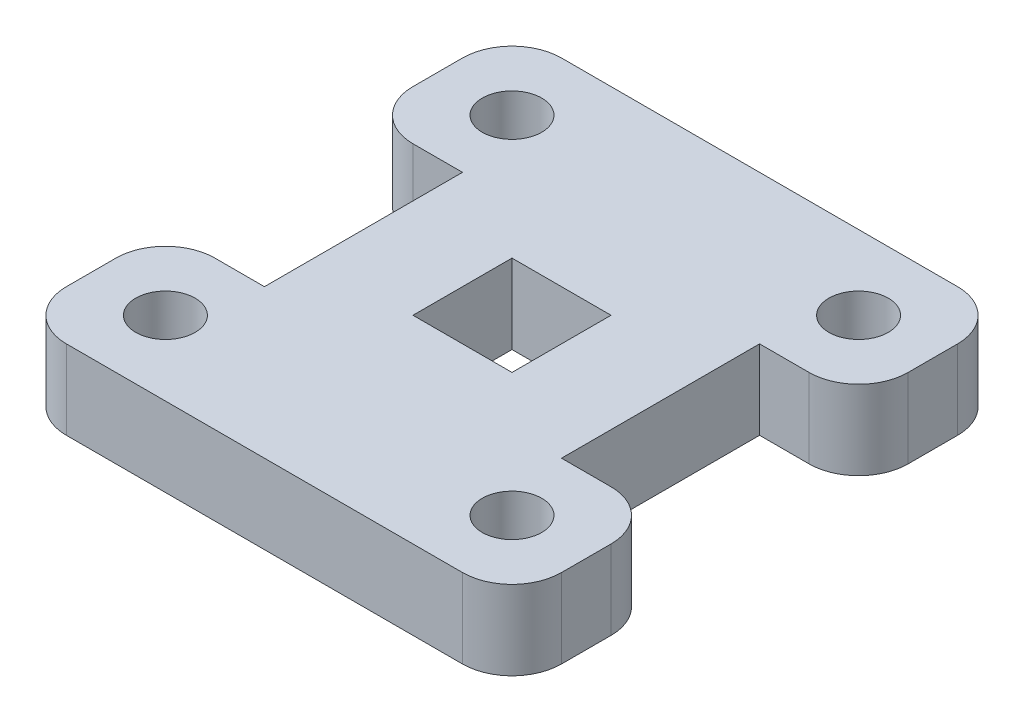
ISO-10303-21;
HEADER;
FILE_DESCRIPTION(('STEP AP214'),'2;1');
FILE_NAME('part.step','',(''),(''),'','','');
FILE_SCHEMA(('AUTOMOTIVE_DESIGN { 1 0 10303 214 1 1 1 1 }'));
ENDSEC;
DATA;
#1=APPLICATION_CONTEXT('core data for automotive mechanical design processes');
#2=APPLICATION_PROTOCOL_DEFINITION('international standard','automotive_design',2000,#1);
#3=PRODUCT_CONTEXT('',#1,'mechanical');
#4=PRODUCT('Part','Part','',(#3));
#5=PRODUCT_RELATED_PRODUCT_CATEGORY('part','',(#4));
#6=PRODUCT_DEFINITION_FORMATION('','',#4);
#7=PRODUCT_DEFINITION_CONTEXT('part definition',#1,'design');
#8=PRODUCT_DEFINITION('design','',#6,#7);
#9=PRODUCT_DEFINITION_SHAPE('','',#8);
#10=(LENGTH_UNIT() NAMED_UNIT(*) SI_UNIT(.MILLI.,.METRE.));
#11=(NAMED_UNIT(*) PLANE_ANGLE_UNIT() SI_UNIT($,.RADIAN.));
#12=(NAMED_UNIT(*) SI_UNIT($,.STERADIAN.) SOLID_ANGLE_UNIT());
#13=UNCERTAINTY_MEASURE_WITH_UNIT(LENGTH_MEASURE(1.E-05),#10,'distance_accuracy_value','');
#14=(GEOMETRIC_REPRESENTATION_CONTEXT(3) GLOBAL_UNCERTAINTY_ASSIGNED_CONTEXT((#13)) GLOBAL_UNIT_ASSIGNED_CONTEXT((#10,
#11,#12)) REPRESENTATION_CONTEXT('',''));
#15=CARTESIAN_POINT('',(0.,0.,0.));
#16=DIRECTION('',(0.,0.,1.));
#17=DIRECTION('',(1.,0.,0.));
#18=AXIS2_PLACEMENT_3D('',#15,#16,#17);
#19=CARTESIAN_POINT('',(-40.,16.,30.));
#20=DIRECTION('',(0.,1.,0.));
#21=DIRECTION('',(0.,0.,1.));
#22=AXIS2_PLACEMENT_3D('',#19,#20,#21);
#23=PLANE('',#22);
#24=CARTESIAN_POINT('',(35.,16.,35.));
#25=DIRECTION('',(0.,1.,0.));
#26=DIRECTION('',(0.,0.,1.));
#27=AXIS2_PLACEMENT_3D('',#24,#25,#26);
#28=CIRCLE('',#27,5.99999999999999);
#29=CARTESIAN_POINT('',(35.,16.,41.));
#30=VERTEX_POINT('',#29);
#31=EDGE_CURVE('E877',#30,#30,#28,.T.);
#32=ORIENTED_EDGE('',*,*,#31,.F.);
#33=EDGE_LOOP('',(#32));
#34=FACE_BOUND('',#33,.T.);
#35=CARTESIAN_POINT('',(-35.,16.,-35.));
#36=DIRECTION('',(0.,1.,0.));
#37=DIRECTION('',(0.,0.,1.));
#38=AXIS2_PLACEMENT_3D('',#35,#36,#37);
#39=CIRCLE('',#38,5.99999999999999);
#40=CARTESIAN_POINT('',(-35.,16.,-29.));
#41=VERTEX_POINT('',#40);
#42=EDGE_CURVE('E240',#41,#41,#39,.T.);
#43=ORIENTED_EDGE('',*,*,#42,.F.);
#44=EDGE_LOOP('',(#43));
#45=FACE_BOUND('',#44,.T.);
#46=DIRECTION('',(1.,0.,0.));
#47=VECTOR('',#46,1.);
#48=CARTESIAN_POINT('',(-39.9999999999999,16.,-20.));
#49=LINE('',#48,#47);
#50=CARTESIAN_POINT('',(-39.9999999999999,16.,-20.));
#51=VERTEX_POINT('',#50);
#52=CARTESIAN_POINT('',(-30.,16.,-20.));
#53=VERTEX_POINT('',#52);
#54=EDGE_CURVE('E256',#51,#53,#49,.T.);
#55=ORIENTED_EDGE('',*,*,#54,.T.);
#56=DIRECTION('',(0.,0.,1.));
#57=VECTOR('',#56,1.);
#58=CARTESIAN_POINT('',(-30.,16.,-20.));
#59=LINE('',#58,#57);
#60=CARTESIAN_POINT('',(-30.,16.,20.));
#61=VERTEX_POINT('',#60);
#62=EDGE_CURVE('E260',#53,#61,#59,.T.);
#63=ORIENTED_EDGE('',*,*,#62,.T.);
#64=DIRECTION('',(-1.,0.,0.));
#65=VECTOR('',#64,1.);
#66=CARTESIAN_POINT('',(-39.9999999999999,16.,20.));
#67=LINE('',#66,#65);
#68=CARTESIAN_POINT('',(-39.9999999999999,16.,20.));
#69=VERTEX_POINT('',#68);
#70=EDGE_CURVE('E264',#61,#69,#67,.T.);
#71=ORIENTED_EDGE('',*,*,#70,.T.);
#72=CARTESIAN_POINT('',(-40.,16.,30.));
#73=DIRECTION('',(0.,1.,0.));
#74=DIRECTION('',(0.,0.,1.));
#75=AXIS2_PLACEMENT_3D('',#72,#73,#74);
#76=CIRCLE('',#75,10.);
#77=CARTESIAN_POINT('',(-50.,16.,30.0000000000001));
#78=VERTEX_POINT('',#77);
#79=EDGE_CURVE('E267',#69,#78,#76,.T.);
#80=ORIENTED_EDGE('',*,*,#79,.T.);
#81=DIRECTION('',(0.,0.,1.));
#82=VECTOR('',#81,1.);
#83=CARTESIAN_POINT('',(-50.,16.,39.9999999999999));
#84=LINE('',#83,#82);
#85=CARTESIAN_POINT('',(-50.,16.,39.9999999999999));
#86=VERTEX_POINT('',#85);
#87=EDGE_CURVE('E270',#78,#86,#84,.T.);
#88=ORIENTED_EDGE('',*,*,#87,.T.);
#89=CARTESIAN_POINT('',(-40.,16.,40.));
#90=DIRECTION('',(0.,1.,0.));
#91=DIRECTION('',(0.,0.,-1.));
#92=AXIS2_PLACEMENT_3D('',#89,#90,#91);
#93=CIRCLE('',#92,9.99999999999999);
#94=CARTESIAN_POINT('',(-39.9999999999999,16.,50.));
#95=VERTEX_POINT('',#94);
#96=EDGE_CURVE('E273',#86,#95,#93,.T.);
#97=ORIENTED_EDGE('',*,*,#96,.T.);
#98=DIRECTION('',(1.,0.,0.));
#99=VECTOR('',#98,1.);
#100=CARTESIAN_POINT('',(-39.9999999999999,16.,50.));
#101=LINE('',#100,#99);
#102=CARTESIAN_POINT('',(39.9999999999999,16.,50.));
#103=VERTEX_POINT('',#102);
#104=EDGE_CURVE('E276',#95,#103,#101,.T.);
#105=ORIENTED_EDGE('',*,*,#104,.T.);
#106=CARTESIAN_POINT('',(40.,16.,40.));
#107=DIRECTION('',(0.,1.,0.));
#108=DIRECTION('',(0.,0.,1.));
#109=AXIS2_PLACEMENT_3D('',#106,#107,#108);
#110=CIRCLE('',#109,10.);
#111=CARTESIAN_POINT('',(50.,16.,39.9999999999999));
#112=VERTEX_POINT('',#111);
#113=EDGE_CURVE('E279',#103,#112,#110,.T.);
#114=ORIENTED_EDGE('',*,*,#113,.T.);
#115=DIRECTION('',(0.,0.,-1.));
#116=VECTOR('',#115,1.);
#117=CARTESIAN_POINT('',(50.,16.,39.9999999999999));
#118=LINE('',#117,#116);
#119=CARTESIAN_POINT('',(50.,16.,30.0000000000001));
#120=VERTEX_POINT('',#119);
#121=EDGE_CURVE('E282',#112,#120,#118,.T.);
#122=ORIENTED_EDGE('',*,*,#121,.T.);
#123=CARTESIAN_POINT('',(40.,16.,30.));
#124=DIRECTION('',(0.,1.,0.));
#125=DIRECTION('',(0.,0.,-1.));
#126=AXIS2_PLACEMENT_3D('',#123,#124,#125);
#127=CIRCLE('',#126,10.);
#128=CARTESIAN_POINT('',(39.9999999999999,16.,20.));
#129=VERTEX_POINT('',#128);
#130=EDGE_CURVE('E285',#120,#129,#127,.T.);
#131=ORIENTED_EDGE('',*,*,#130,.T.);
#132=DIRECTION('',(-1.,0.,0.));
#133=VECTOR('',#132,1.);
#134=CARTESIAN_POINT('',(30.,16.,20.));
#135=LINE('',#134,#133);
#136=CARTESIAN_POINT('',(30.,16.,20.));
#137=VERTEX_POINT('',#136);
#138=EDGE_CURVE('E288',#129,#137,#135,.T.);
#139=ORIENTED_EDGE('',*,*,#138,.T.);
#140=DIRECTION('',(0.,0.,-1.));
#141=VECTOR('',#140,1.);
#142=CARTESIAN_POINT('',(30.,16.,-20.));
#143=LINE('',#142,#141);
#144=CARTESIAN_POINT('',(30.,16.,-20.));
#145=VERTEX_POINT('',#144);
#146=EDGE_CURVE('E291',#137,#145,#143,.T.);
#147=ORIENTED_EDGE('',*,*,#146,.T.);
#148=DIRECTION('',(1.,0.,0.));
#149=VECTOR('',#148,1.);
#150=CARTESIAN_POINT('',(30.,16.,-20.));
#151=LINE('',#150,#149);
#152=CARTESIAN_POINT('',(39.9999999999999,16.,-20.));
#153=VERTEX_POINT('',#152);
#154=EDGE_CURVE('E294',#145,#153,#151,.T.);
#155=ORIENTED_EDGE('',*,*,#154,.T.);
#156=CARTESIAN_POINT('',(40.,16.,-30.));
#157=DIRECTION('',(0.,1.,0.));
#158=DIRECTION('',(0.,0.,1.));
#159=AXIS2_PLACEMENT_3D('',#156,#157,#158);
#160=CIRCLE('',#159,10.);
#161=CARTESIAN_POINT('',(50.,16.,-30.0000000000001));
#162=VERTEX_POINT('',#161);
#163=EDGE_CURVE('E297',#153,#162,#160,.T.);
#164=ORIENTED_EDGE('',*,*,#163,.T.);
#165=DIRECTION('',(0.,0.,-1.));
#166=VECTOR('',#165,1.);
#167=CARTESIAN_POINT('',(50.,16.,-30.0000000000001));
#168=LINE('',#167,#166);
#169=CARTESIAN_POINT('',(50.,16.,-39.9999999999999));
#170=VERTEX_POINT('',#169);
#171=EDGE_CURVE('E300',#162,#170,#168,.T.);
#172=ORIENTED_EDGE('',*,*,#171,.T.);
#173=CARTESIAN_POINT('',(40.,16.,-40.));
#174=DIRECTION('',(0.,1.,0.));
#175=DIRECTION('',(0.,0.,-1.));
#176=AXIS2_PLACEMENT_3D('',#173,#174,#175);
#177=CIRCLE('',#176,9.99999999999999);
#178=CARTESIAN_POINT('',(39.9999999999999,16.,-50.));
#179=VERTEX_POINT('',#178);
#180=EDGE_CURVE('E303',#170,#179,#177,.T.);
#181=ORIENTED_EDGE('',*,*,#180,.T.);
#182=DIRECTION('',(-1.,0.,0.));
#183=VECTOR('',#182,1.);
#184=CARTESIAN_POINT('',(-39.9999999999999,16.,-50.));
#185=LINE('',#184,#183);
#186=CARTESIAN_POINT('',(-39.9999999999999,16.,-50.));
#187=VERTEX_POINT('',#186);
#188=EDGE_CURVE('E306',#179,#187,#185,.T.);
#189=ORIENTED_EDGE('',*,*,#188,.T.);
#190=CARTESIAN_POINT('',(-40.,16.,-40.));
#191=DIRECTION('',(0.,1.,0.));
#192=DIRECTION('',(0.,0.,-1.));
#193=AXIS2_PLACEMENT_3D('',#190,#191,#192);
#194=CIRCLE('',#193,10.);
#195=CARTESIAN_POINT('',(-50.,16.,-39.9999999999999));
#196=VERTEX_POINT('',#195);
#197=EDGE_CURVE('E309',#187,#196,#194,.T.);
#198=ORIENTED_EDGE('',*,*,#197,.T.);
#199=DIRECTION('',(0.,0.,1.));
#200=VECTOR('',#199,1.);
#201=CARTESIAN_POINT('',(-50.,16.,-30.0000000000001));
#202=LINE('',#201,#200);
#203=CARTESIAN_POINT('',(-50.,16.,-30.0000000000001));
#204=VERTEX_POINT('',#203);
#205=EDGE_CURVE('E312',#196,#204,#202,.T.);
#206=ORIENTED_EDGE('',*,*,#205,.T.);
#207=CARTESIAN_POINT('',(-40.,16.,-30.));
#208=DIRECTION('',(0.,1.,0.));
#209=DIRECTION('',(0.,0.,-1.));
#210=AXIS2_PLACEMENT_3D('',#207,#208,#209);
#211=CIRCLE('',#210,10.);
#212=EDGE_CURVE('E315',#204,#51,#211,.T.);
#213=ORIENTED_EDGE('',*,*,#212,.T.);
#214=EDGE_LOOP('',(#55,#63,#71,#80,#88,#97,#105,#114,#122,#131,#139,#147,#155,#164,#172,#181,
#189,#198,#206,#213));
#215=FACE_BOUND('',#214,.T.);
#216=DIRECTION('',(-1.,0.,0.));
#217=VECTOR('',#216,1.);
#218=CARTESIAN_POINT('',(-10.,16.,-10.));
#219=LINE('',#218,#217);
#220=CARTESIAN_POINT('',(10.,16.,-10.));
#221=VERTEX_POINT('',#220);
#222=CARTESIAN_POINT('',(-10.,16.,-10.));
#223=VERTEX_POINT('',#222);
#224=EDGE_CURVE('E214',#221,#223,#219,.T.);
#225=ORIENTED_EDGE('',*,*,#224,.F.);
#226=DIRECTION('',(0.,0.,-1.));
#227=VECTOR('',#226,1.);
#228=CARTESIAN_POINT('',(10.,16.,10.));
#229=LINE('',#228,#227);
#230=CARTESIAN_POINT('',(10.,16.,10.));
#231=VERTEX_POINT('',#230);
#232=EDGE_CURVE('E205',#231,#221,#229,.T.);
#233=ORIENTED_EDGE('',*,*,#232,.F.);
#234=DIRECTION('',(1.,0.,0.));
#235=VECTOR('',#234,1.);
#236=CARTESIAN_POINT('',(-10.,16.,10.));
#237=LINE('',#236,#235);
#238=CARTESIAN_POINT('',(-10.,16.,10.));
#239=VERTEX_POINT('',#238);
#240=EDGE_CURVE('E232',#239,#231,#237,.T.);
#241=ORIENTED_EDGE('',*,*,#240,.F.);
#242=DIRECTION('',(0.,0.,1.));
#243=VECTOR('',#242,1.);
#244=CARTESIAN_POINT('',(-10.,16.,10.));
#245=LINE('',#244,#243);
#246=EDGE_CURVE('E228',#223,#239,#245,.T.);
#247=ORIENTED_EDGE('',*,*,#246,.F.);
#248=EDGE_LOOP('',(#225,#233,#241,#247));
#249=FACE_BOUND('',#248,.T.);
#250=CARTESIAN_POINT('',(35.,16.,-35.));
#251=DIRECTION('',(0.,1.,0.));
#252=DIRECTION('',(0.,0.,-1.));
#253=AXIS2_PLACEMENT_3D('',#250,#251,#252);
#254=CIRCLE('',#253,5.99999999999999);
#255=CARTESIAN_POINT('',(35.,16.,-41.));
#256=VERTEX_POINT('',#255);
#257=EDGE_CURVE('E885',#256,#256,#254,.T.);
#258=ORIENTED_EDGE('',*,*,#257,.F.);
#259=EDGE_LOOP('',(#258));
#260=FACE_BOUND('',#259,.T.);
#261=CARTESIAN_POINT('',(-35.,16.,35.));
#262=DIRECTION('',(0.,1.,0.));
#263=DIRECTION('',(0.,0.,-1.));
#264=AXIS2_PLACEMENT_3D('',#261,#262,#263);
#265=CIRCLE('',#264,5.99999999999999);
#266=CARTESIAN_POINT('',(-35.,16.,29.));
#267=VERTEX_POINT('',#266);
#268=EDGE_CURVE('E866',#267,#267,#265,.T.);
#269=ORIENTED_EDGE('',*,*,#268,.F.);
#270=EDGE_LOOP('',(#269));
#271=FACE_BOUND('',#270,.T.);
#272=ADVANCED_FACE('F43',(#34,#45,#215,#249,#260,#271),#23,.T.);
#273=CARTESIAN_POINT('',(-40.,0.,30.));
#274=DIRECTION('',(0.,1.,0.));
#275=DIRECTION('',(0.,0.,1.));
#276=AXIS2_PLACEMENT_3D('',#273,#274,#275);
#277=PLANE('',#276);
#278=DIRECTION('',(1.,0.,0.));
#279=VECTOR('',#278,1.);
#280=CARTESIAN_POINT('',(-39.9999999999999,0.,-20.));
#281=LINE('',#280,#279);
#282=CARTESIAN_POINT('',(-39.9999999999999,0.,-20.));
#283=VERTEX_POINT('',#282);
#284=CARTESIAN_POINT('',(-30.,0.,-20.));
#285=VERTEX_POINT('',#284);
#286=EDGE_CURVE('E223',#283,#285,#281,.T.);
#287=ORIENTED_EDGE('',*,*,#286,.F.);
#288=CARTESIAN_POINT('',(-40.,0.,-30.));
#289=DIRECTION('',(0.,1.,0.));
#290=DIRECTION('',(0.,0.,-1.));
#291=AXIS2_PLACEMENT_3D('',#288,#289,#290);
#292=CIRCLE('',#291,10.);
#293=CARTESIAN_POINT('',(-50.,0.,-30.0000000000001));
#294=VERTEX_POINT('',#293);
#295=EDGE_CURVE('E261',#294,#283,#292,.T.);
#296=ORIENTED_EDGE('',*,*,#295,.F.);
#297=DIRECTION('',(0.,0.,1.));
#298=VECTOR('',#297,1.);
#299=CARTESIAN_POINT('',(-50.,0.,-30.0000000000001));
#300=LINE('',#299,#298);
#301=CARTESIAN_POINT('',(-50.,0.,-39.9999999999999));
#302=VERTEX_POINT('',#301);
#303=EDGE_CURVE('E373',#302,#294,#300,.T.);
#304=ORIENTED_EDGE('',*,*,#303,.F.);
#305=CARTESIAN_POINT('',(-40.,0.,-40.));
#306=DIRECTION('',(0.,1.,0.));
#307=DIRECTION('',(0.,0.,-1.));
#308=AXIS2_PLACEMENT_3D('',#305,#306,#307);
#309=CIRCLE('',#308,10.);
#310=CARTESIAN_POINT('',(-39.9999999999999,0.,-50.));
#311=VERTEX_POINT('',#310);
#312=EDGE_CURVE('E370',#311,#302,#309,.T.);
#313=ORIENTED_EDGE('',*,*,#312,.F.);
#314=DIRECTION('',(-1.,0.,0.));
#315=VECTOR('',#314,1.);
#316=CARTESIAN_POINT('',(-39.9999999999999,0.,-50.));
#317=LINE('',#316,#315);
#318=CARTESIAN_POINT('',(39.9999999999999,0.,-50.));
#319=VERTEX_POINT('',#318);
#320=EDGE_CURVE('E367',#319,#311,#317,.T.);
#321=ORIENTED_EDGE('',*,*,#320,.F.);
#322=CARTESIAN_POINT('',(40.,0.,-40.));
#323=DIRECTION('',(0.,1.,0.));
#324=DIRECTION('',(0.,0.,-1.));
#325=AXIS2_PLACEMENT_3D('',#322,#323,#324);
#326=CIRCLE('',#325,9.99999999999999);
#327=CARTESIAN_POINT('',(50.,0.,-39.9999999999999));
#328=VERTEX_POINT('',#327);
#329=EDGE_CURVE('E364',#328,#319,#326,.T.);
#330=ORIENTED_EDGE('',*,*,#329,.F.);
#331=DIRECTION('',(0.,0.,-1.));
#332=VECTOR('',#331,1.);
#333=CARTESIAN_POINT('',(50.,0.,-30.0000000000001));
#334=LINE('',#333,#332);
#335=CARTESIAN_POINT('',(50.,0.,-30.0000000000001));
#336=VERTEX_POINT('',#335);
#337=EDGE_CURVE('E361',#336,#328,#334,.T.);
#338=ORIENTED_EDGE('',*,*,#337,.F.);
#339=CARTESIAN_POINT('',(40.,0.,-30.));
#340=DIRECTION('',(0.,1.,0.));
#341=DIRECTION('',(0.,0.,1.));
#342=AXIS2_PLACEMENT_3D('',#339,#340,#341);
#343=CIRCLE('',#342,10.);
#344=CARTESIAN_POINT('',(39.9999999999999,0.,-20.));
#345=VERTEX_POINT('',#344);
#346=EDGE_CURVE('E358',#345,#336,#343,.T.);
#347=ORIENTED_EDGE('',*,*,#346,.F.);
#348=DIRECTION('',(1.,0.,0.));
#349=VECTOR('',#348,1.);
#350=CARTESIAN_POINT('',(30.,0.,-20.));
#351=LINE('',#350,#349);
#352=CARTESIAN_POINT('',(30.,0.,-20.));
#353=VERTEX_POINT('',#352);
#354=EDGE_CURVE('E355',#353,#345,#351,.T.);
#355=ORIENTED_EDGE('',*,*,#354,.F.);
#356=DIRECTION('',(0.,0.,-1.));
#357=VECTOR('',#356,1.);
#358=CARTESIAN_POINT('',(30.,0.,-20.));
#359=LINE('',#358,#357);
#360=CARTESIAN_POINT('',(30.,0.,20.));
#361=VERTEX_POINT('',#360);
#362=EDGE_CURVE('E352',#361,#353,#359,.T.);
#363=ORIENTED_EDGE('',*,*,#362,.F.);
#364=DIRECTION('',(-1.,0.,0.));
#365=VECTOR('',#364,1.);
#366=CARTESIAN_POINT('',(30.,0.,20.));
#367=LINE('',#366,#365);
#368=CARTESIAN_POINT('',(39.9999999999999,0.,20.));
#369=VERTEX_POINT('',#368);
#370=EDGE_CURVE('E349',#369,#361,#367,.T.);
#371=ORIENTED_EDGE('',*,*,#370,.F.);
#372=CARTESIAN_POINT('',(40.,0.,30.));
#373=DIRECTION('',(0.,1.,0.));
#374=DIRECTION('',(0.,0.,-1.));
#375=AXIS2_PLACEMENT_3D('',#372,#373,#374);
#376=CIRCLE('',#375,10.);
#377=CARTESIAN_POINT('',(50.,0.,30.0000000000001));
#378=VERTEX_POINT('',#377);
#379=EDGE_CURVE('E346',#378,#369,#376,.T.);
#380=ORIENTED_EDGE('',*,*,#379,.F.);
#381=DIRECTION('',(0.,0.,-1.));
#382=VECTOR('',#381,1.);
#383=CARTESIAN_POINT('',(50.,0.,39.9999999999999));
#384=LINE('',#383,#382);
#385=CARTESIAN_POINT('',(50.,0.,39.9999999999999));
#386=VERTEX_POINT('',#385);
#387=EDGE_CURVE('E343',#386,#378,#384,.T.);
#388=ORIENTED_EDGE('',*,*,#387,.F.);
#389=CARTESIAN_POINT('',(40.,0.,40.));
#390=DIRECTION('',(0.,1.,0.));
#391=DIRECTION('',(0.,0.,1.));
#392=AXIS2_PLACEMENT_3D('',#389,#390,#391);
#393=CIRCLE('',#392,10.);
#394=CARTESIAN_POINT('',(39.9999999999999,0.,50.));
#395=VERTEX_POINT('',#394);
#396=EDGE_CURVE('E340',#395,#386,#393,.T.);
#397=ORIENTED_EDGE('',*,*,#396,.F.);
#398=DIRECTION('',(1.,0.,0.));
#399=VECTOR('',#398,1.);
#400=CARTESIAN_POINT('',(-39.9999999999999,0.,50.));
#401=LINE('',#400,#399);
#402=CARTESIAN_POINT('',(-39.9999999999999,0.,50.));
#403=VERTEX_POINT('',#402);
#404=EDGE_CURVE('E337',#403,#395,#401,.T.);
#405=ORIENTED_EDGE('',*,*,#404,.F.);
#406=CARTESIAN_POINT('',(-40.,0.,40.));
#407=DIRECTION('',(0.,1.,0.));
#408=DIRECTION('',(0.,0.,-1.));
#409=AXIS2_PLACEMENT_3D('',#406,#407,#408);
#410=CIRCLE('',#409,9.99999999999999);
#411=CARTESIAN_POINT('',(-50.,0.,39.9999999999999));
#412=VERTEX_POINT('',#411);
#413=EDGE_CURVE('E334',#412,#403,#410,.T.);
#414=ORIENTED_EDGE('',*,*,#413,.F.);
#415=DIRECTION('',(0.,0.,1.));
#416=VECTOR('',#415,1.);
#417=CARTESIAN_POINT('',(-50.,0.,39.9999999999999));
#418=LINE('',#417,#416);
#419=CARTESIAN_POINT('',(-50.,0.,30.0000000000001));
#420=VERTEX_POINT('',#419);
#421=EDGE_CURVE('E331',#420,#412,#418,.T.);
#422=ORIENTED_EDGE('',*,*,#421,.F.);
#423=CARTESIAN_POINT('',(-40.,0.,30.));
#424=DIRECTION('',(0.,1.,0.));
#425=DIRECTION('',(0.,0.,1.));
#426=AXIS2_PLACEMENT_3D('',#423,#424,#425);
#427=CIRCLE('',#426,10.);
#428=CARTESIAN_POINT('',(-39.9999999999999,0.,20.));
#429=VERTEX_POINT('',#428);
#430=EDGE_CURVE('E328',#429,#420,#427,.T.);
#431=ORIENTED_EDGE('',*,*,#430,.F.);
#432=DIRECTION('',(-1.,0.,0.));
#433=VECTOR('',#432,1.);
#434=CARTESIAN_POINT('',(-39.9999999999999,0.,20.));
#435=LINE('',#434,#433);
#436=CARTESIAN_POINT('',(-30.,0.,20.));
#437=VERTEX_POINT('',#436);
#438=EDGE_CURVE('E325',#437,#429,#435,.T.);
#439=ORIENTED_EDGE('',*,*,#438,.F.);
#440=DIRECTION('',(0.,0.,1.));
#441=VECTOR('',#440,1.);
#442=CARTESIAN_POINT('',(-30.,0.,-20.));
#443=LINE('',#442,#441);
#444=EDGE_CURVE('E322',#285,#437,#443,.T.);
#445=ORIENTED_EDGE('',*,*,#444,.F.);
#446=EDGE_LOOP('',(#287,#296,#304,#313,#321,#330,#338,#347,#355,#363,#371,#380,#388,#397,#405,
#414,#422,#431,#439,#445));
#447=FACE_BOUND('',#446,.T.);
#448=DIRECTION('',(0.,0.,-1.));
#449=VECTOR('',#448,1.);
#450=CARTESIAN_POINT('',(10.,0.,10.));
#451=LINE('',#450,#449);
#452=CARTESIAN_POINT('',(10.,0.,10.));
#453=VERTEX_POINT('',#452);
#454=CARTESIAN_POINT('',(10.,0.,-10.));
#455=VERTEX_POINT('',#454);
#456=EDGE_CURVE('E67',#453,#455,#451,.T.);
#457=ORIENTED_EDGE('',*,*,#456,.T.);
#458=DIRECTION('',(-1.,0.,0.));
#459=VECTOR('',#458,1.);
#460=CARTESIAN_POINT('',(-10.,0.,-10.));
#461=LINE('',#460,#459);
#462=CARTESIAN_POINT('',(-10.,0.,-10.));
#463=VERTEX_POINT('',#462);
#464=EDGE_CURVE('E221',#455,#463,#461,.T.);
#465=ORIENTED_EDGE('',*,*,#464,.T.);
#466=DIRECTION('',(0.,0.,1.));
#467=VECTOR('',#466,1.);
#468=CARTESIAN_POINT('',(-10.,0.,10.));
#469=LINE('',#468,#467);
#470=CARTESIAN_POINT('',(-10.,0.,10.));
#471=VERTEX_POINT('',#470);
#472=EDGE_CURVE('E243',#463,#471,#469,.T.);
#473=ORIENTED_EDGE('',*,*,#472,.T.);
#474=DIRECTION('',(1.,0.,0.));
#475=VECTOR('',#474,1.);
#476=CARTESIAN_POINT('',(-10.,0.,10.));
#477=LINE('',#476,#475);
#478=EDGE_CURVE('E215',#471,#453,#477,.T.);
#479=ORIENTED_EDGE('',*,*,#478,.T.);
#480=EDGE_LOOP('',(#457,#465,#473,#479));
#481=FACE_BOUND('',#480,.T.);
#482=CARTESIAN_POINT('',(-35.,0.,-35.));
#483=DIRECTION('',(0.,1.,0.));
#484=DIRECTION('',(0.,0.,1.));
#485=AXIS2_PLACEMENT_3D('',#482,#483,#484);
#486=CIRCLE('',#485,5.99999999999999);
#487=CARTESIAN_POINT('',(-35.,0.,-29.));
#488=VERTEX_POINT('',#487);
#489=EDGE_CURVE('E889',#488,#488,#486,.T.);
#490=ORIENTED_EDGE('',*,*,#489,.T.);
#491=EDGE_LOOP('',(#490));
#492=FACE_BOUND('',#491,.T.);
#493=CARTESIAN_POINT('',(35.,0.,-35.));
#494=DIRECTION('',(0.,1.,0.));
#495=DIRECTION('',(0.,0.,-1.));
#496=AXIS2_PLACEMENT_3D('',#493,#494,#495);
#497=CIRCLE('',#496,5.99999999999999);
#498=CARTESIAN_POINT('',(35.,0.,-41.));
#499=VERTEX_POINT('',#498);
#500=EDGE_CURVE('E881',#499,#499,#497,.T.);
#501=ORIENTED_EDGE('',*,*,#500,.T.);
#502=EDGE_LOOP('',(#501));
#503=FACE_BOUND('',#502,.T.);
#504=CARTESIAN_POINT('',(35.,0.,35.));
#505=DIRECTION('',(0.,1.,0.));
#506=DIRECTION('',(0.,0.,1.));
#507=AXIS2_PLACEMENT_3D('',#504,#505,#506);
#508=CIRCLE('',#507,5.99999999999999);
#509=CARTESIAN_POINT('',(35.,0.,41.));
#510=VERTEX_POINT('',#509);
#511=EDGE_CURVE('E874',#510,#510,#508,.T.);
#512=ORIENTED_EDGE('',*,*,#511,.T.);
#513=EDGE_LOOP('',(#512));
#514=FACE_BOUND('',#513,.T.);
#515=CARTESIAN_POINT('',(-35.,0.,35.));
#516=DIRECTION('',(0.,1.,0.));
#517=DIRECTION('',(0.,0.,-1.));
#518=AXIS2_PLACEMENT_3D('',#515,#516,#517);
#519=CIRCLE('',#518,5.99999999999999);
#520=CARTESIAN_POINT('',(-35.,0.,29.));
#521=VERTEX_POINT('',#520);
#522=EDGE_CURVE('E869',#521,#521,#519,.T.);
#523=ORIENTED_EDGE('',*,*,#522,.T.);
#524=EDGE_LOOP('',(#523));
#525=FACE_BOUND('',#524,.T.);
#526=ADVANCED_FACE('F460',(#447,#481,#492,#503,#514,#525),#277,.F.);
#527=CARTESIAN_POINT('',(-39.9999999999999,16.,-20.));
#528=DIRECTION('',(0.,0.,-1.));
#529=DIRECTION('',(-1.,0.,0.));
#530=AXIS2_PLACEMENT_3D('',#527,#528,#529);
#531=PLANE('',#530);
#532=ORIENTED_EDGE('',*,*,#286,.T.);
#533=DIRECTION('',(0.,-1.,0.));
#534=VECTOR('',#533,1.);
#535=CARTESIAN_POINT('',(-30.,16.,-20.));
#536=LINE('',#535,#534);
#537=EDGE_CURVE('E11',#53,#285,#536,.T.);
#538=ORIENTED_EDGE('',*,*,#537,.F.);
#539=ORIENTED_EDGE('',*,*,#54,.F.);
#540=DIRECTION('',(0.,-1.,0.));
#541=VECTOR('',#540,1.);
#542=CARTESIAN_POINT('',(-39.9999999999999,16.,-20.));
#543=LINE('',#542,#541);
#544=EDGE_CURVE('E318',#51,#283,#543,.T.);
#545=ORIENTED_EDGE('',*,*,#544,.T.);
#546=EDGE_LOOP('',(#532,#538,#539,#545));
#547=FACE_BOUND('',#546,.T.);
#548=ADVANCED_FACE('F45',(#547),#531,.F.);
#549=CARTESIAN_POINT('',(-30.,16.,-20.));
#550=DIRECTION('',(1.,0.,0.));
#551=DIRECTION('',(0.,0.,-1.));
#552=AXIS2_PLACEMENT_3D('',#549,#550,#551);
#553=PLANE('',#552);
#554=ORIENTED_EDGE('',*,*,#444,.T.);
#555=DIRECTION('',(0.,-1.,0.));
#556=VECTOR('',#555,1.);
#557=CARTESIAN_POINT('',(-30.,16.,20.));
#558=LINE('',#557,#556);
#559=EDGE_CURVE('E52',#61,#437,#558,.T.);
#560=ORIENTED_EDGE('',*,*,#559,.F.);
#561=ORIENTED_EDGE('',*,*,#62,.F.);
#562=ORIENTED_EDGE('',*,*,#537,.T.);
#563=EDGE_LOOP('',(#554,#560,#561,#562));
#564=FACE_BOUND('',#563,.T.);
#565=ADVANCED_FACE('F477',(#564),#553,.F.);
#566=CARTESIAN_POINT('',(-39.9999999999999,16.,20.));
#567=DIRECTION('',(0.,0.,1.));
#568=DIRECTION('',(1.,0.,0.));
#569=AXIS2_PLACEMENT_3D('',#566,#567,#568);
#570=PLANE('',#569);
#571=ORIENTED_EDGE('',*,*,#438,.T.);
#572=DIRECTION('',(0.,-1.,0.));
#573=VECTOR('',#572,1.);
#574=CARTESIAN_POINT('',(-39.9999999999999,16.,20.));
#575=LINE('',#574,#573);
#576=EDGE_CURVE('E445',#69,#429,#575,.T.);
#577=ORIENTED_EDGE('',*,*,#576,.F.);
#578=ORIENTED_EDGE('',*,*,#70,.F.);
#579=ORIENTED_EDGE('',*,*,#559,.T.);
#580=EDGE_LOOP('',(#571,#577,#578,#579));
#581=FACE_BOUND('',#580,.T.);
#582=ADVANCED_FACE('F454',(#581),#570,.F.);
#583=CARTESIAN_POINT('',(-40.,16.,30.));
#584=DIRECTION('',(0.,-1.,0.));
#585=DIRECTION('',(0.,0.,-1.));
#586=AXIS2_PLACEMENT_3D('',#583,#584,#585);
#587=CYLINDRICAL_SURFACE('',#586,10.);
#588=ORIENTED_EDGE('',*,*,#430,.T.);
#589=DIRECTION('',(0.,-1.,0.));
#590=VECTOR('',#589,1.);
#591=CARTESIAN_POINT('',(-50.,16.,30.0000000000001));
#592=LINE('',#591,#590);
#593=EDGE_CURVE('E441',#78,#420,#592,.T.);
#594=ORIENTED_EDGE('',*,*,#593,.F.);
#595=ORIENTED_EDGE('',*,*,#79,.F.);
#596=ORIENTED_EDGE('',*,*,#576,.T.);
#597=EDGE_LOOP('',(#588,#594,#595,#596));
#598=FACE_BOUND('',#597,.T.);
#599=ADVANCED_FACE('F466',(#598),#587,.T.);
#600=CARTESIAN_POINT('',(-50.,16.,39.9999999999999));
#601=DIRECTION('',(1.,0.,0.));
#602=DIRECTION('',(0.,0.,-1.));
#603=AXIS2_PLACEMENT_3D('',#600,#601,#602);
#604=PLANE('',#603);
#605=ORIENTED_EDGE('',*,*,#421,.T.);
#606=DIRECTION('',(0.,-1.,0.));
#607=VECTOR('',#606,1.);
#608=CARTESIAN_POINT('',(-50.,16.,39.9999999999999));
#609=LINE('',#608,#607);
#610=EDGE_CURVE('E437',#86,#412,#609,.T.);
#611=ORIENTED_EDGE('',*,*,#610,.F.);
#612=ORIENTED_EDGE('',*,*,#87,.F.);
#613=ORIENTED_EDGE('',*,*,#593,.T.);
#614=EDGE_LOOP('',(#605,#611,#612,#613));
#615=FACE_BOUND('',#614,.T.);
#616=ADVANCED_FACE('F470',(#615),#604,.F.);
#617=CARTESIAN_POINT('',(-40.,16.,40.));
#618=DIRECTION('',(0.,-1.,0.));
#619=DIRECTION('',(0.,0.,-1.));
#620=AXIS2_PLACEMENT_3D('',#617,#618,#619);
#621=CYLINDRICAL_SURFACE('',#620,9.99999999999999);
#622=ORIENTED_EDGE('',*,*,#413,.T.);
#623=DIRECTION('',(0.,-1.,0.));
#624=VECTOR('',#623,1.);
#625=CARTESIAN_POINT('',(-39.9999999999999,16.,50.));
#626=LINE('',#625,#624);
#627=EDGE_CURVE('E433',#95,#403,#626,.T.);
#628=ORIENTED_EDGE('',*,*,#627,.F.);
#629=ORIENTED_EDGE('',*,*,#96,.F.);
#630=ORIENTED_EDGE('',*,*,#610,.T.);
#631=EDGE_LOOP('',(#622,#628,#629,#630));
#632=FACE_BOUND('',#631,.T.);
#633=ADVANCED_FACE('F550',(#632),#621,.T.);
#634=CARTESIAN_POINT('',(-39.9999999999999,16.,50.));
#635=DIRECTION('',(0.,0.,-1.));
#636=DIRECTION('',(-1.,0.,0.));
#637=AXIS2_PLACEMENT_3D('',#634,#635,#636);
#638=PLANE('',#637);
#639=ORIENTED_EDGE('',*,*,#404,.T.);
#640=DIRECTION('',(0.,-1.,0.));
#641=VECTOR('',#640,1.);
#642=CARTESIAN_POINT('',(39.9999999999999,16.,50.));
#643=LINE('',#642,#641);
#644=EDGE_CURVE('E429',#103,#395,#643,.T.);
#645=ORIENTED_EDGE('',*,*,#644,.F.);
#646=ORIENTED_EDGE('',*,*,#104,.F.);
#647=ORIENTED_EDGE('',*,*,#627,.T.);
#648=EDGE_LOOP('',(#639,#645,#646,#647));
#649=FACE_BOUND('',#648,.T.);
#650=ADVANCED_FACE('F548',(#649),#638,.F.);
#651=CARTESIAN_POINT('',(40.,16.,40.));
#652=DIRECTION('',(0.,-1.,0.));
#653=DIRECTION('',(0.,0.,-1.));
#654=AXIS2_PLACEMENT_3D('',#651,#652,#653);
#655=CYLINDRICAL_SURFACE('',#654,10.);
#656=ORIENTED_EDGE('',*,*,#396,.T.);
#657=DIRECTION('',(0.,-1.,0.));
#658=VECTOR('',#657,1.);
#659=CARTESIAN_POINT('',(50.,16.,39.9999999999999));
#660=LINE('',#659,#658);
#661=EDGE_CURVE('E425',#112,#386,#660,.T.);
#662=ORIENTED_EDGE('',*,*,#661,.F.);
#663=ORIENTED_EDGE('',*,*,#113,.F.);
#664=ORIENTED_EDGE('',*,*,#644,.T.);
#665=EDGE_LOOP('',(#656,#662,#663,#664));
#666=FACE_BOUND('',#665,.T.);
#667=ADVANCED_FACE('F543',(#666),#655,.T.);
#668=CARTESIAN_POINT('',(50.,16.,39.9999999999999));
#669=DIRECTION('',(-1.,0.,0.));
#670=DIRECTION('',(0.,0.,1.));
#671=AXIS2_PLACEMENT_3D('',#668,#669,#670);
#672=PLANE('',#671);
#673=ORIENTED_EDGE('',*,*,#387,.T.);
#674=DIRECTION('',(0.,-1.,0.));
#675=VECTOR('',#674,1.);
#676=CARTESIAN_POINT('',(50.,16.,30.0000000000001));
#677=LINE('',#676,#675);
#678=EDGE_CURVE('E421',#120,#378,#677,.T.);
#679=ORIENTED_EDGE('',*,*,#678,.F.);
#680=ORIENTED_EDGE('',*,*,#121,.F.);
#681=ORIENTED_EDGE('',*,*,#661,.T.);
#682=EDGE_LOOP('',(#673,#679,#680,#681));
#683=FACE_BOUND('',#682,.T.);
#684=ADVANCED_FACE('F538',(#683),#672,.F.);
#685=CARTESIAN_POINT('',(40.,16.,30.));
#686=DIRECTION('',(0.,-1.,0.));
#687=DIRECTION('',(0.,0.,-1.));
#688=AXIS2_PLACEMENT_3D('',#685,#686,#687);
#689=CYLINDRICAL_SURFACE('',#688,10.);
#690=ORIENTED_EDGE('',*,*,#379,.T.);
#691=DIRECTION('',(0.,-1.,0.));
#692=VECTOR('',#691,1.);
#693=CARTESIAN_POINT('',(39.9999999999999,16.,20.));
#694=LINE('',#693,#692);
#695=EDGE_CURVE('E417',#129,#369,#694,.T.);
#696=ORIENTED_EDGE('',*,*,#695,.F.);
#697=ORIENTED_EDGE('',*,*,#130,.F.);
#698=ORIENTED_EDGE('',*,*,#678,.T.);
#699=EDGE_LOOP('',(#690,#696,#697,#698));
#700=FACE_BOUND('',#699,.T.);
#701=ADVANCED_FACE('F534',(#700),#689,.T.);
#702=CARTESIAN_POINT('',(30.,16.,20.));
#703=DIRECTION('',(0.,0.,1.));
#704=DIRECTION('',(1.,0.,0.));
#705=AXIS2_PLACEMENT_3D('',#702,#703,#704);
#706=PLANE('',#705);
#707=ORIENTED_EDGE('',*,*,#370,.T.);
#708=DIRECTION('',(0.,-1.,0.));
#709=VECTOR('',#708,1.);
#710=CARTESIAN_POINT('',(30.,16.,20.));
#711=LINE('',#710,#709);
#712=EDGE_CURVE('E413',#137,#361,#711,.T.);
#713=ORIENTED_EDGE('',*,*,#712,.F.);
#714=ORIENTED_EDGE('',*,*,#138,.F.);
#715=ORIENTED_EDGE('',*,*,#695,.T.);
#716=EDGE_LOOP('',(#707,#713,#714,#715));
#717=FACE_BOUND('',#716,.T.);
#718=ADVANCED_FACE('F529',(#717),#706,.F.);
#719=CARTESIAN_POINT('',(30.,16.,-20.));
#720=DIRECTION('',(-1.,0.,0.));
#721=DIRECTION('',(0.,0.,1.));
#722=AXIS2_PLACEMENT_3D('',#719,#720,#721);
#723=PLANE('',#722);
#724=ORIENTED_EDGE('',*,*,#362,.T.);
#725=DIRECTION('',(0.,-1.,0.));
#726=VECTOR('',#725,1.);
#727=CARTESIAN_POINT('',(30.,16.,-20.));
#728=LINE('',#727,#726);
#729=EDGE_CURVE('E409',#145,#353,#728,.T.);
#730=ORIENTED_EDGE('',*,*,#729,.F.);
#731=ORIENTED_EDGE('',*,*,#146,.F.);
#732=ORIENTED_EDGE('',*,*,#712,.T.);
#733=EDGE_LOOP('',(#724,#730,#731,#732));
#734=FACE_BOUND('',#733,.T.);
#735=ADVANCED_FACE('F523',(#734),#723,.F.);
#736=CARTESIAN_POINT('',(30.,16.,-20.));
#737=DIRECTION('',(0.,0.,-1.));
#738=DIRECTION('',(-1.,0.,0.));
#739=AXIS2_PLACEMENT_3D('',#736,#737,#738);
#740=PLANE('',#739);
#741=ORIENTED_EDGE('',*,*,#354,.T.);
#742=DIRECTION('',(0.,-1.,0.));
#743=VECTOR('',#742,1.);
#744=CARTESIAN_POINT('',(39.9999999999999,16.,-20.));
#745=LINE('',#744,#743);
#746=EDGE_CURVE('E405',#153,#345,#745,.T.);
#747=ORIENTED_EDGE('',*,*,#746,.F.);
#748=ORIENTED_EDGE('',*,*,#154,.F.);
#749=ORIENTED_EDGE('',*,*,#729,.T.);
#750=EDGE_LOOP('',(#741,#747,#748,#749));
#751=FACE_BOUND('',#750,.T.);
#752=ADVANCED_FACE('F519',(#751),#740,.F.);
#753=CARTESIAN_POINT('',(40.,16.,-30.));
#754=DIRECTION('',(0.,-1.,0.));
#755=DIRECTION('',(0.,0.,-1.));
#756=AXIS2_PLACEMENT_3D('',#753,#754,#755);
#757=CYLINDRICAL_SURFACE('',#756,10.);
#758=ORIENTED_EDGE('',*,*,#346,.T.);
#759=DIRECTION('',(0.,-1.,0.));
#760=VECTOR('',#759,1.);
#761=CARTESIAN_POINT('',(50.,16.,-30.0000000000001));
#762=LINE('',#761,#760);
#763=EDGE_CURVE('E401',#162,#336,#762,.T.);
#764=ORIENTED_EDGE('',*,*,#763,.F.);
#765=ORIENTED_EDGE('',*,*,#163,.F.);
#766=ORIENTED_EDGE('',*,*,#746,.T.);
#767=EDGE_LOOP('',(#758,#764,#765,#766));
#768=FACE_BOUND('',#767,.T.);
#769=ADVANCED_FACE('F514',(#768),#757,.T.);
#770=CARTESIAN_POINT('',(50.,16.,-30.0000000000001));
#771=DIRECTION('',(-1.,0.,0.));
#772=DIRECTION('',(0.,0.,1.));
#773=AXIS2_PLACEMENT_3D('',#770,#771,#772);
#774=PLANE('',#773);
#775=ORIENTED_EDGE('',*,*,#337,.T.);
#776=DIRECTION('',(0.,-1.,0.));
#777=VECTOR('',#776,1.);
#778=CARTESIAN_POINT('',(50.,16.,-39.9999999999999));
#779=LINE('',#778,#777);
#780=EDGE_CURVE('E397',#170,#328,#779,.T.);
#781=ORIENTED_EDGE('',*,*,#780,.F.);
#782=ORIENTED_EDGE('',*,*,#171,.F.);
#783=ORIENTED_EDGE('',*,*,#763,.T.);
#784=EDGE_LOOP('',(#775,#781,#782,#783));
#785=FACE_BOUND('',#784,.T.);
#786=ADVANCED_FACE('F508',(#785),#774,.F.);
#787=CARTESIAN_POINT('',(40.,16.,-40.));
#788=DIRECTION('',(0.,-1.,0.));
#789=DIRECTION('',(0.,0.,-1.));
#790=AXIS2_PLACEMENT_3D('',#787,#788,#789);
#791=CYLINDRICAL_SURFACE('',#790,9.99999999999999);
#792=ORIENTED_EDGE('',*,*,#329,.T.);
#793=DIRECTION('',(0.,-1.,0.));
#794=VECTOR('',#793,1.);
#795=CARTESIAN_POINT('',(39.9999999999999,16.,-50.));
#796=LINE('',#795,#794);
#797=EDGE_CURVE('E393',#179,#319,#796,.T.);
#798=ORIENTED_EDGE('',*,*,#797,.F.);
#799=ORIENTED_EDGE('',*,*,#180,.F.);
#800=ORIENTED_EDGE('',*,*,#780,.T.);
#801=EDGE_LOOP('',(#792,#798,#799,#800));
#802=FACE_BOUND('',#801,.T.);
#803=ADVANCED_FACE('F504',(#802),#791,.T.);
#804=CARTESIAN_POINT('',(-39.9999999999999,16.,-50.));
#805=DIRECTION('',(0.,0.,1.));
#806=DIRECTION('',(1.,0.,0.));
#807=AXIS2_PLACEMENT_3D('',#804,#805,#806);
#808=PLANE('',#807);
#809=ORIENTED_EDGE('',*,*,#320,.T.);
#810=DIRECTION('',(0.,-1.,0.));
#811=VECTOR('',#810,1.);
#812=CARTESIAN_POINT('',(-39.9999999999999,16.,-50.));
#813=LINE('',#812,#811);
#814=EDGE_CURVE('E389',#187,#311,#813,.T.);
#815=ORIENTED_EDGE('',*,*,#814,.F.);
#816=ORIENTED_EDGE('',*,*,#188,.F.);
#817=ORIENTED_EDGE('',*,*,#797,.T.);
#818=EDGE_LOOP('',(#809,#815,#816,#817));
#819=FACE_BOUND('',#818,.T.);
#820=ADVANCED_FACE('F499',(#819),#808,.F.);
#821=CARTESIAN_POINT('',(-40.,16.,-40.));
#822=DIRECTION('',(0.,-1.,0.));
#823=DIRECTION('',(0.,0.,-1.));
#824=AXIS2_PLACEMENT_3D('',#821,#822,#823);
#825=CYLINDRICAL_SURFACE('',#824,10.);
#826=ORIENTED_EDGE('',*,*,#312,.T.);
#827=DIRECTION('',(0.,-1.,0.));
#828=VECTOR('',#827,1.);
#829=CARTESIAN_POINT('',(-50.,16.,-39.9999999999999));
#830=LINE('',#829,#828);
#831=EDGE_CURVE('E385',#196,#302,#830,.T.);
#832=ORIENTED_EDGE('',*,*,#831,.F.);
#833=ORIENTED_EDGE('',*,*,#197,.F.);
#834=ORIENTED_EDGE('',*,*,#814,.T.);
#835=EDGE_LOOP('',(#826,#832,#833,#834));
#836=FACE_BOUND('',#835,.T.);
#837=ADVANCED_FACE('F493',(#836),#825,.T.);
#838=CARTESIAN_POINT('',(-50.,16.,-30.0000000000001));
#839=DIRECTION('',(1.,0.,0.));
#840=DIRECTION('',(0.,0.,-1.));
#841=AXIS2_PLACEMENT_3D('',#838,#839,#840);
#842=PLANE('',#841);
#843=ORIENTED_EDGE('',*,*,#303,.T.);
#844=DIRECTION('',(0.,-1.,0.));
#845=VECTOR('',#844,1.);
#846=CARTESIAN_POINT('',(-50.,16.,-30.0000000000001));
#847=LINE('',#846,#845);
#848=EDGE_CURVE('E381',#204,#294,#847,.T.);
#849=ORIENTED_EDGE('',*,*,#848,.F.);
#850=ORIENTED_EDGE('',*,*,#205,.F.);
#851=ORIENTED_EDGE('',*,*,#831,.T.);
#852=EDGE_LOOP('',(#843,#849,#850,#851));
#853=FACE_BOUND('',#852,.T.);
#854=ADVANCED_FACE('F489',(#853),#842,.F.);
#855=CARTESIAN_POINT('',(-40.,16.,-30.));
#856=DIRECTION('',(0.,-1.,0.));
#857=DIRECTION('',(0.,0.,-1.));
#858=AXIS2_PLACEMENT_3D('',#855,#856,#857);
#859=CYLINDRICAL_SURFACE('',#858,10.);
#860=ORIENTED_EDGE('',*,*,#295,.T.);
#861=ORIENTED_EDGE('',*,*,#544,.F.);
#862=ORIENTED_EDGE('',*,*,#212,.F.);
#863=ORIENTED_EDGE('',*,*,#848,.T.);
#864=EDGE_LOOP('',(#860,#861,#862,#863));
#865=FACE_BOUND('',#864,.T.);
#866=ADVANCED_FACE('F484',(#865),#859,.T.);
#867=CARTESIAN_POINT('',(10.,16.,10.));
#868=DIRECTION('',(-1.,0.,0.));
#869=DIRECTION('',(0.,0.,1.));
#870=AXIS2_PLACEMENT_3D('',#867,#868,#869);
#871=PLANE('',#870);
#872=ORIENTED_EDGE('',*,*,#456,.F.);
#873=DIRECTION('',(0.,-1.,0.));
#874=VECTOR('',#873,1.);
#875=CARTESIAN_POINT('',(10.,16.,10.));
#876=LINE('',#875,#874);
#877=EDGE_CURVE('E209',#231,#453,#876,.T.);
#878=ORIENTED_EDGE('',*,*,#877,.F.);
#879=ORIENTED_EDGE('',*,*,#232,.T.);
#880=DIRECTION('',(0.,-1.,0.));
#881=VECTOR('',#880,1.);
#882=CARTESIAN_POINT('',(10.,16.,-10.));
#883=LINE('',#882,#881);
#884=EDGE_CURVE('E208',#221,#455,#883,.T.);
#885=ORIENTED_EDGE('',*,*,#884,.T.);
#886=EDGE_LOOP('',(#872,#878,#879,#885));
#887=FACE_BOUND('',#886,.T.);
#888=ADVANCED_FACE('F207',(#887),#871,.T.);
#889=CARTESIAN_POINT('',(-10.,16.,-10.));
#890=DIRECTION('',(0.,0.,1.));
#891=DIRECTION('',(1.,0.,0.));
#892=AXIS2_PLACEMENT_3D('',#889,#890,#891);
#893=PLANE('',#892);
#894=ORIENTED_EDGE('',*,*,#464,.F.);
#895=ORIENTED_EDGE('',*,*,#884,.F.);
#896=ORIENTED_EDGE('',*,*,#224,.T.);
#897=DIRECTION('',(0.,-1.,0.));
#898=VECTOR('',#897,1.);
#899=CARTESIAN_POINT('',(-10.,16.,-10.));
#900=LINE('',#899,#898);
#901=EDGE_CURVE('E224',#223,#463,#900,.T.);
#902=ORIENTED_EDGE('',*,*,#901,.T.);
#903=EDGE_LOOP('',(#894,#895,#896,#902));
#904=FACE_BOUND('',#903,.T.);
#905=ADVANCED_FACE('F218',(#904),#893,.T.);
#906=CARTESIAN_POINT('',(-10.,16.,10.));
#907=DIRECTION('',(1.,0.,0.));
#908=DIRECTION('',(0.,0.,-1.));
#909=AXIS2_PLACEMENT_3D('',#906,#907,#908);
#910=PLANE('',#909);
#911=ORIENTED_EDGE('',*,*,#472,.F.);
#912=ORIENTED_EDGE('',*,*,#901,.F.);
#913=ORIENTED_EDGE('',*,*,#246,.T.);
#914=DIRECTION('',(0.,-1.,0.));
#915=VECTOR('',#914,1.);
#916=CARTESIAN_POINT('',(-10.,16.,10.));
#917=LINE('',#916,#915);
#918=EDGE_CURVE('E59',#239,#471,#917,.T.);
#919=ORIENTED_EDGE('',*,*,#918,.T.);
#920=EDGE_LOOP('',(#911,#912,#913,#919));
#921=FACE_BOUND('',#920,.T.);
#922=ADVANCED_FACE('F659',(#921),#910,.T.);
#923=CARTESIAN_POINT('',(-10.,16.,10.));
#924=DIRECTION('',(0.,0.,-1.));
#925=DIRECTION('',(-1.,0.,0.));
#926=AXIS2_PLACEMENT_3D('',#923,#924,#925);
#927=PLANE('',#926);
#928=ORIENTED_EDGE('',*,*,#478,.F.);
#929=ORIENTED_EDGE('',*,*,#918,.F.);
#930=ORIENTED_EDGE('',*,*,#240,.T.);
#931=ORIENTED_EDGE('',*,*,#877,.T.);
#932=EDGE_LOOP('',(#928,#929,#930,#931));
#933=FACE_BOUND('',#932,.T.);
#934=ADVANCED_FACE('F665',(#933),#927,.T.);
#935=CARTESIAN_POINT('',(-35.,16.,-35.));
#936=DIRECTION('',(0.,-1.,0.));
#937=DIRECTION('',(0.,0.,-1.));
#938=AXIS2_PLACEMENT_3D('',#935,#936,#937);
#939=CYLINDRICAL_SURFACE('',#938,5.99999999999999);
#940=ORIENTED_EDGE('',*,*,#42,.T.);
#941=EDGE_LOOP('',(#940));
#942=FACE_BOUND('',#941,.T.);
#943=ORIENTED_EDGE('',*,*,#489,.F.);
#944=EDGE_LOOP('',(#943));
#945=FACE_BOUND('',#944,.T.);
#946=ADVANCED_FACE('F673',(#942,#945),#939,.F.);
#947=CARTESIAN_POINT('',(35.,16.,-35.));
#948=DIRECTION('',(0.,-1.,0.));
#949=DIRECTION('',(0.,0.,-1.));
#950=AXIS2_PLACEMENT_3D('',#947,#948,#949);
#951=CYLINDRICAL_SURFACE('',#950,5.99999999999999);
#952=ORIENTED_EDGE('',*,*,#257,.T.);
#953=EDGE_LOOP('',(#952));
#954=FACE_BOUND('',#953,.T.);
#955=ORIENTED_EDGE('',*,*,#500,.F.);
#956=EDGE_LOOP('',(#955));
#957=FACE_BOUND('',#956,.T.);
#958=ADVANCED_FACE('F680',(#954,#957),#951,.F.);
#959=CARTESIAN_POINT('',(35.,16.,35.));
#960=DIRECTION('',(0.,-1.,0.));
#961=DIRECTION('',(0.,0.,-1.));
#962=AXIS2_PLACEMENT_3D('',#959,#960,#961);
#963=CYLINDRICAL_SURFACE('',#962,5.99999999999999);
#964=ORIENTED_EDGE('',*,*,#31,.T.);
#965=EDGE_LOOP('',(#964));
#966=FACE_BOUND('',#965,.T.);
#967=ORIENTED_EDGE('',*,*,#511,.F.);
#968=EDGE_LOOP('',(#967));
#969=FACE_BOUND('',#968,.T.);
#970=ADVANCED_FACE('F688',(#966,#969),#963,.F.);
#971=CARTESIAN_POINT('',(-35.,16.,35.));
#972=DIRECTION('',(0.,-1.,0.));
#973=DIRECTION('',(0.,0.,-1.));
#974=AXIS2_PLACEMENT_3D('',#971,#972,#973);
#975=CYLINDRICAL_SURFACE('',#974,5.99999999999999);
#976=ORIENTED_EDGE('',*,*,#268,.T.);
#977=EDGE_LOOP('',(#976));
#978=FACE_BOUND('',#977,.T.);
#979=ORIENTED_EDGE('',*,*,#522,.F.);
#980=EDGE_LOOP('',(#979));
#981=FACE_BOUND('',#980,.T.);
#982=ADVANCED_FACE('F696',(#978,#981),#975,.F.);
#983=CLOSED_SHELL('',(#272,#526,#548,#565,#582,#599,#616,#633,#650,#667,#684,#701,#718,#735,
#752,#769,#786,#803,#820,#837,#854,#866,#888,#905,#922,#934,#946,#958,#970,#982));
#984=MANIFOLD_SOLID_BREP('B2',#983);
#985=ADVANCED_BREP_SHAPE_REPRESENTATION('',(#18,#984),#14);
#986=SHAPE_DEFINITION_REPRESENTATION(#9,#985);
ENDSEC;
END-ISO-10303-21;
